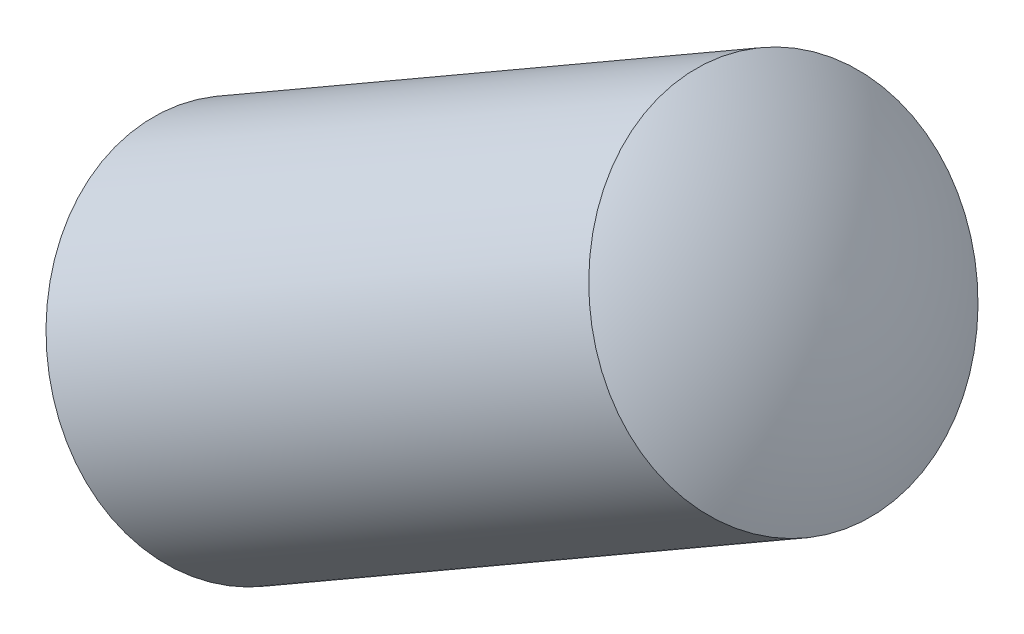
ISO-10303-21;
HEADER;
FILE_DESCRIPTION(('STEP AP214'),'2;1');
FILE_NAME('part.step','',(''),(''),'','','');
FILE_SCHEMA(('AUTOMOTIVE_DESIGN { 1 0 10303 214 1 1 1 1 }'));
ENDSEC;
DATA;
#1=APPLICATION_CONTEXT('core data for automotive mechanical design processes');
#2=APPLICATION_PROTOCOL_DEFINITION('international standard','automotive_design',2000,#1);
#3=PRODUCT_CONTEXT('',#1,'mechanical');
#4=PRODUCT('Part','Part','',(#3));
#5=PRODUCT_RELATED_PRODUCT_CATEGORY('part','',(#4));
#6=PRODUCT_DEFINITION_FORMATION('','',#4);
#7=PRODUCT_DEFINITION_CONTEXT('part definition',#1,'design');
#8=PRODUCT_DEFINITION('design','',#6,#7);
#9=PRODUCT_DEFINITION_SHAPE('','',#8);
#10=(LENGTH_UNIT() NAMED_UNIT(*) SI_UNIT(.MILLI.,.METRE.));
#11=(NAMED_UNIT(*) PLANE_ANGLE_UNIT() SI_UNIT($,.RADIAN.));
#12=(NAMED_UNIT(*) SI_UNIT($,.STERADIAN.) SOLID_ANGLE_UNIT());
#13=UNCERTAINTY_MEASURE_WITH_UNIT(LENGTH_MEASURE(1.E-05),#10,'distance_accuracy_value','');
#14=(GEOMETRIC_REPRESENTATION_CONTEXT(3) GLOBAL_UNCERTAINTY_ASSIGNED_CONTEXT((#13)) GLOBAL_UNIT_ASSIGNED_CONTEXT((#10,
#11,#12)) REPRESENTATION_CONTEXT('',''));
#15=CARTESIAN_POINT('',(0.,0.,0.));
#16=DIRECTION('',(0.,0.,1.));
#17=DIRECTION('',(1.,0.,0.));
#18=AXIS2_PLACEMENT_3D('',#15,#16,#17);
#19=CARTESIAN_POINT('',(23.90396719429,13.8009618943233,0.9));
#20=DIRECTION('',(0.5,-0.866025403784439,0.));
#21=DIRECTION('',(0.866025403784439,0.5,0.));
#22=AXIS2_PLACEMENT_3D('',#19,#20,#21);
#23=SPHERICAL_SURFACE('',#22,3.);
#24=CARTESIAN_POINT('',(23.90396719429,13.8009618943233,0.9));
#25=DIRECTION('',(-0.866025403784439,-0.5,0.));
#26=DIRECTION('',(0.,0.,-1.));
#27=AXIS2_PLACEMENT_3D('',#24,#25,#26);
#28=SPHERICAL_SURFACE('',#27,3.);
#29=CARTESIAN_POINT('',(26.15396719429,15.1,0.9));
#30=DIRECTION('',(-0.866025403784439,-0.5,0.));
#31=DIRECTION('',(0.,0.,-1.));
#32=AXIS2_PLACEMENT_3D('',#29,#30,#31);
#33=CIRCLE('',#32,1.5);
#34=CARTESIAN_POINT('',(26.15396719429,15.1,-0.6));
#35=VERTEX_POINT('',#34);
#36=EDGE_CURVE('E11',#35,#35,#33,.T.);
#37=ORIENTED_EDGE('',*,*,#36,.F.);
#38=EDGE_LOOP('',(#37));
#39=FACE_BOUND('',#38,.T.);
#40=ADVANCED_FACE('F17',(#39),#28,.T.);
#41=CARTESIAN_POINT('',(23.7274300138541,13.6990381056767,0.9));
#42=DIRECTION('',(0.5,-0.866025403784439,0.));
#43=DIRECTION('',(-0.866025403784439,-0.5,0.));
#44=AXIS2_PLACEMENT_3D('',#41,#42,#43);
#45=SPHERICAL_SURFACE('',#44,3.);
#46=CARTESIAN_POINT('',(23.7274300138541,13.6990381056767,0.9));
#47=DIRECTION('',(-0.866025403784439,-0.5,0.));
#48=DIRECTION('',(0.,0.,-1.));
#49=AXIS2_PLACEMENT_3D('',#46,#47,#48);
#50=SPHERICAL_SURFACE('',#49,3.);
#51=CARTESIAN_POINT('',(21.4774300138541,12.4,0.9));
#52=DIRECTION('',(-0.866025403784439,-0.5,0.));
#53=DIRECTION('',(0.,0.,-1.));
#54=AXIS2_PLACEMENT_3D('',#51,#52,#53);
#55=CIRCLE('',#54,1.5);
#56=CARTESIAN_POINT('',(21.4774300138541,12.4,-0.6));
#57=VERTEX_POINT('',#56);
#58=EDGE_CURVE('E26',#57,#57,#55,.T.);
#59=ORIENTED_EDGE('',*,*,#58,.T.);
#60=EDGE_LOOP('',(#59));
#61=FACE_BOUND('',#60,.T.);
#62=ADVANCED_FACE('F19',(#61),#50,.T.);
#63=CARTESIAN_POINT('',(22.6465643089631,13.075,0.9));
#64=DIRECTION('',(-0.866025403784439,-0.5,0.));
#65=DIRECTION('',(0.,0.,-1.));
#66=AXIS2_PLACEMENT_3D('',#63,#64,#65);
#67=CYLINDRICAL_SURFACE('',#66,1.5);
#68=ORIENTED_EDGE('',*,*,#36,.T.);
#69=EDGE_LOOP('',(#68));
#70=FACE_BOUND('',#69,.T.);
#71=ORIENTED_EDGE('',*,*,#58,.F.);
#72=EDGE_LOOP('',(#71));
#73=FACE_BOUND('',#72,.T.);
#74=ADVANCED_FACE('F57',(#70,#73),#67,.T.);
#75=CLOSED_SHELL('',(#40,#62,#74));
#76=MANIFOLD_SOLID_BREP('B1',#75);
#77=ADVANCED_BREP_SHAPE_REPRESENTATION('',(#18,#76),#14);
#78=SHAPE_DEFINITION_REPRESENTATION(#9,#77);
ENDSEC;
END-ISO-10303-21;
